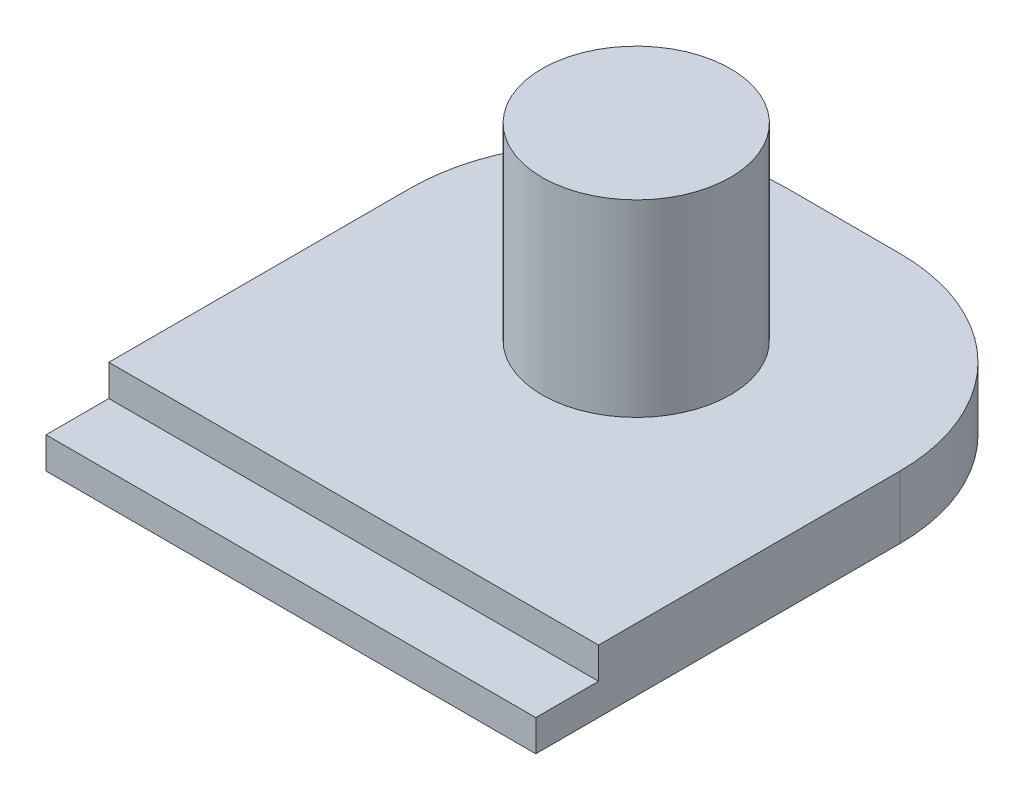
ISO-10303-21;
HEADER;
FILE_DESCRIPTION(('STEP AP214'),'2;1');
FILE_NAME('part.step','',(''),(''),'','','');
FILE_SCHEMA(('AUTOMOTIVE_DESIGN { 1 0 10303 214 1 1 1 1 }'));
ENDSEC;
DATA;
#1=APPLICATION_CONTEXT('core data for automotive mechanical design processes');
#2=APPLICATION_PROTOCOL_DEFINITION('international standard','automotive_design',2000,#1);
#3=PRODUCT_CONTEXT('',#1,'mechanical');
#4=PRODUCT('Part','Part','',(#3));
#5=PRODUCT_RELATED_PRODUCT_CATEGORY('part','',(#4));
#6=PRODUCT_DEFINITION_FORMATION('','',#4);
#7=PRODUCT_DEFINITION_CONTEXT('part definition',#1,'design');
#8=PRODUCT_DEFINITION('design','',#6,#7);
#9=PRODUCT_DEFINITION_SHAPE('','',#8);
#10=(LENGTH_UNIT() NAMED_UNIT(*) SI_UNIT(.MILLI.,.METRE.));
#11=(NAMED_UNIT(*) PLANE_ANGLE_UNIT() SI_UNIT($,.RADIAN.));
#12=(NAMED_UNIT(*) SI_UNIT($,.STERADIAN.) SOLID_ANGLE_UNIT());
#13=UNCERTAINTY_MEASURE_WITH_UNIT(LENGTH_MEASURE(1.E-05),#10,'distance_accuracy_value','');
#14=(GEOMETRIC_REPRESENTATION_CONTEXT(3) GLOBAL_UNCERTAINTY_ASSIGNED_CONTEXT((#13)) GLOBAL_UNIT_ASSIGNED_CONTEXT((#10,
#11,#12)) REPRESENTATION_CONTEXT('',''));
#15=CARTESIAN_POINT('',(0.,0.,0.));
#16=DIRECTION('',(0.,0.,1.));
#17=DIRECTION('',(1.,0.,0.));
#18=AXIS2_PLACEMENT_3D('',#15,#16,#17);
#19=CARTESIAN_POINT('',(0.,1.,0.));
#20=DIRECTION('',(1.,0.,0.));
#21=DIRECTION('',(0.,0.,-1.));
#22=AXIS2_PLACEMENT_3D('',#19,#20,#21);
#23=PLANE('',#22);
#24=DIRECTION('',(0.,0.,1.));
#25=VECTOR('',#24,1.);
#26=CARTESIAN_POINT('',(0.,0.5,0.));
#27=LINE('',#26,#25);
#28=CARTESIAN_POINT('',(0.,0.5,-1.));
#29=VERTEX_POINT('',#28);
#30=CARTESIAN_POINT('',(0.,0.5,0.));
#31=VERTEX_POINT('',#30);
#32=EDGE_CURVE('E105',#29,#31,#27,.T.);
#33=ORIENTED_EDGE('',*,*,#32,.F.);
#34=DIRECTION('',(0.,1.,0.));
#35=VECTOR('',#34,1.);
#36=CARTESIAN_POINT('',(0.,0.5,-1.));
#37=LINE('',#36,#35);
#38=CARTESIAN_POINT('',(0.,1.,-1.));
#39=VERTEX_POINT('',#38);
#40=EDGE_CURVE('E176',#29,#39,#37,.T.);
#41=ORIENTED_EDGE('',*,*,#40,.T.);
#42=DIRECTION('',(0.,0.,1.));
#43=VECTOR('',#42,1.);
#44=CARTESIAN_POINT('',(0.,1.,0.));
#45=LINE('',#44,#43);
#46=CARTESIAN_POINT('',(0.,1.,-5.79999999999998));
#47=VERTEX_POINT('',#46);
#48=EDGE_CURVE('E146',#47,#39,#45,.T.);
#49=ORIENTED_EDGE('',*,*,#48,.F.);
#50=DIRECTION('',(0.,-1.,0.));
#51=VECTOR('',#50,1.);
#52=CARTESIAN_POINT('',(0.,1.,-5.79999999999998));
#53=LINE('',#52,#51);
#54=CARTESIAN_POINT('',(0.,0.,-5.79999999999998));
#55=VERTEX_POINT('',#54);
#56=EDGE_CURVE('E127',#47,#55,#53,.T.);
#57=ORIENTED_EDGE('',*,*,#56,.T.);
#58=DIRECTION('',(0.,0.,1.));
#59=VECTOR('',#58,1.);
#60=CARTESIAN_POINT('',(0.,0.,0.));
#61=LINE('',#60,#59);
#62=CARTESIAN_POINT('',(0.,0.,0.));
#63=VERTEX_POINT('',#62);
#64=EDGE_CURVE('E125',#55,#63,#61,.T.);
#65=ORIENTED_EDGE('',*,*,#64,.T.);
#66=DIRECTION('',(0.,-1.,0.));
#67=VECTOR('',#66,1.);
#68=CARTESIAN_POINT('',(0.,1.,0.));
#69=LINE('',#68,#67);
#70=EDGE_CURVE('E11',#31,#63,#69,.T.);
#71=ORIENTED_EDGE('',*,*,#70,.F.);
#72=EDGE_LOOP('',(#33,#41,#49,#57,#65,#71));
#73=FACE_BOUND('',#72,.T.);
#74=ADVANCED_FACE('F32',(#73),#23,.F.);
#75=CARTESIAN_POINT('',(0.,1.,0.));
#76=DIRECTION('',(0.,0.,-1.));
#77=DIRECTION('',(-1.,0.,0.));
#78=AXIS2_PLACEMENT_3D('',#75,#76,#77);
#79=PLANE('',#78);
#80=DIRECTION('',(0.,-1.,0.));
#81=VECTOR('',#80,1.);
#82=CARTESIAN_POINT('',(7.8,1.,0.));
#83=LINE('',#82,#81);
#84=CARTESIAN_POINT('',(7.8,0.5,0.));
#85=VERTEX_POINT('',#84);
#86=CARTESIAN_POINT('',(7.8,0.,0.));
#87=VERTEX_POINT('',#86);
#88=EDGE_CURVE('E39',#85,#87,#83,.T.);
#89=ORIENTED_EDGE('',*,*,#88,.F.);
#90=DIRECTION('',(1.,0.,0.));
#91=VECTOR('',#90,1.);
#92=CARTESIAN_POINT('',(0.,0.5,0.));
#93=LINE('',#92,#91);
#94=EDGE_CURVE('E108',#31,#85,#93,.T.);
#95=ORIENTED_EDGE('',*,*,#94,.F.);
#96=ORIENTED_EDGE('',*,*,#70,.T.);
#97=DIRECTION('',(1.,0.,0.));
#98=VECTOR('',#97,1.);
#99=CARTESIAN_POINT('',(0.,0.,0.));
#100=LINE('',#99,#98);
#101=EDGE_CURVE('E129',#63,#87,#100,.T.);
#102=ORIENTED_EDGE('',*,*,#101,.T.);
#103=EDGE_LOOP('',(#89,#95,#96,#102));
#104=FACE_BOUND('',#103,.T.);
#105=ADVANCED_FACE('F118',(#104),#79,.F.);
#106=CARTESIAN_POINT('',(7.8,1.,0.));
#107=DIRECTION('',(-1.,0.,0.));
#108=DIRECTION('',(0.,0.,1.));
#109=AXIS2_PLACEMENT_3D('',#106,#107,#108);
#110=PLANE('',#109);
#111=DIRECTION('',(0.,0.,-1.));
#112=VECTOR('',#111,1.);
#113=CARTESIAN_POINT('',(7.8,1.,0.));
#114=LINE('',#113,#112);
#115=CARTESIAN_POINT('',(7.8,1.,-1.));
#116=VERTEX_POINT('',#115);
#117=CARTESIAN_POINT('',(7.8,1.,-5.79999999999998));
#118=VERTEX_POINT('',#117);
#119=EDGE_CURVE('E87',#116,#118,#114,.T.);
#120=ORIENTED_EDGE('',*,*,#119,.F.);
#121=DIRECTION('',(0.,1.,0.));
#122=VECTOR('',#121,1.);
#123=CARTESIAN_POINT('',(7.8,0.5,-1.));
#124=LINE('',#123,#122);
#125=CARTESIAN_POINT('',(7.8,0.5,-1.));
#126=VERTEX_POINT('',#125);
#127=EDGE_CURVE('E46',#126,#116,#124,.T.);
#128=ORIENTED_EDGE('',*,*,#127,.F.);
#129=DIRECTION('',(0.,0.,-1.));
#130=VECTOR('',#129,1.);
#131=CARTESIAN_POINT('',(7.8,0.5,0.));
#132=LINE('',#131,#130);
#133=EDGE_CURVE('E121',#85,#126,#132,.T.);
#134=ORIENTED_EDGE('',*,*,#133,.F.);
#135=ORIENTED_EDGE('',*,*,#88,.T.);
#136=DIRECTION('',(0.,0.,-1.));
#137=VECTOR('',#136,1.);
#138=CARTESIAN_POINT('',(7.8,0.,0.));
#139=LINE('',#138,#137);
#140=CARTESIAN_POINT('',(7.8,0.,-5.79999999999998));
#141=VERTEX_POINT('',#140);
#142=EDGE_CURVE('E132',#87,#141,#139,.T.);
#143=ORIENTED_EDGE('',*,*,#142,.T.);
#144=DIRECTION('',(0.,-1.,0.));
#145=VECTOR('',#144,1.);
#146=CARTESIAN_POINT('',(7.8,1.,-5.79999999999998));
#147=LINE('',#146,#145);
#148=EDGE_CURVE('E153',#118,#141,#147,.T.);
#149=ORIENTED_EDGE('',*,*,#148,.F.);
#150=EDGE_LOOP('',(#120,#128,#134,#135,#143,#149));
#151=FACE_BOUND('',#150,.T.);
#152=ADVANCED_FACE('F156',(#151),#110,.F.);
#153=CARTESIAN_POINT('',(4.8,1.,-5.8));
#154=DIRECTION('',(0.,-1.,0.));
#155=DIRECTION('',(0.,0.,-1.));
#156=AXIS2_PLACEMENT_3D('',#153,#154,#155);
#157=CYLINDRICAL_SURFACE('',#156,3.);
#158=CARTESIAN_POINT('',(4.8,0.,-5.8));
#159=DIRECTION('',(0.,1.,0.));
#160=DIRECTION('',(0.,0.,1.));
#161=AXIS2_PLACEMENT_3D('',#158,#159,#160);
#162=CIRCLE('',#161,3.);
#163=CARTESIAN_POINT('',(4.79999999999998,0.,-8.8));
#164=VERTEX_POINT('',#163);
#165=EDGE_CURVE('E141',#141,#164,#162,.T.);
#166=ORIENTED_EDGE('',*,*,#165,.T.);
#167=DIRECTION('',(0.,-1.,0.));
#168=VECTOR('',#167,1.);
#169=CARTESIAN_POINT('',(4.79999999999998,1.,-8.8));
#170=LINE('',#169,#168);
#171=CARTESIAN_POINT('',(4.79999999999998,1.,-8.8));
#172=VERTEX_POINT('',#171);
#173=EDGE_CURVE('E150',#172,#164,#170,.T.);
#174=ORIENTED_EDGE('',*,*,#173,.F.);
#175=CARTESIAN_POINT('',(4.8,1.,-5.8));
#176=DIRECTION('',(0.,1.,0.));
#177=DIRECTION('',(0.,0.,1.));
#178=AXIS2_PLACEMENT_3D('',#175,#176,#177);
#179=CIRCLE('',#178,3.);
#180=EDGE_CURVE('E170',#118,#172,#179,.T.);
#181=ORIENTED_EDGE('',*,*,#180,.F.);
#182=ORIENTED_EDGE('',*,*,#148,.T.);
#183=EDGE_LOOP('',(#166,#174,#181,#182));
#184=FACE_BOUND('',#183,.T.);
#185=ADVANCED_FACE('F163',(#184),#157,.T.);
#186=CARTESIAN_POINT('',(3.00000000000002,1.,-8.8));
#187=DIRECTION('',(0.,0.,1.));
#188=DIRECTION('',(1.,0.,0.));
#189=AXIS2_PLACEMENT_3D('',#186,#187,#188);
#190=PLANE('',#189);
#191=DIRECTION('',(-1.,0.,0.));
#192=VECTOR('',#191,1.);
#193=CARTESIAN_POINT('',(3.00000000000002,0.,-8.8));
#194=LINE('',#193,#192);
#195=CARTESIAN_POINT('',(3.00000000000002,0.,-8.8));
#196=VERTEX_POINT('',#195);
#197=EDGE_CURVE('E143',#164,#196,#194,.T.);
#198=ORIENTED_EDGE('',*,*,#197,.T.);
#199=DIRECTION('',(0.,-1.,0.));
#200=VECTOR('',#199,1.);
#201=CARTESIAN_POINT('',(3.00000000000002,1.,-8.8));
#202=LINE('',#201,#200);
#203=CARTESIAN_POINT('',(3.00000000000002,1.,-8.8));
#204=VERTEX_POINT('',#203);
#205=EDGE_CURVE('E148',#204,#196,#202,.T.);
#206=ORIENTED_EDGE('',*,*,#205,.F.);
#207=DIRECTION('',(-1.,0.,0.));
#208=VECTOR('',#207,1.);
#209=CARTESIAN_POINT('',(3.00000000000002,1.,-8.8));
#210=LINE('',#209,#208);
#211=EDGE_CURVE('E169',#172,#204,#210,.T.);
#212=ORIENTED_EDGE('',*,*,#211,.F.);
#213=ORIENTED_EDGE('',*,*,#173,.T.);
#214=EDGE_LOOP('',(#198,#206,#212,#213));
#215=FACE_BOUND('',#214,.T.);
#216=ADVANCED_FACE('F167',(#215),#190,.F.);
#217=CARTESIAN_POINT('',(3.,1.,-5.8));
#218=DIRECTION('',(0.,-1.,0.));
#219=DIRECTION('',(0.,0.,-1.));
#220=AXIS2_PLACEMENT_3D('',#217,#218,#219);
#221=CYLINDRICAL_SURFACE('',#220,3.);
#222=CARTESIAN_POINT('',(3.,0.,-5.8));
#223=DIRECTION('',(0.,1.,0.));
#224=DIRECTION('',(0.,0.,1.));
#225=AXIS2_PLACEMENT_3D('',#222,#223,#224);
#226=CIRCLE('',#225,3.);
#227=EDGE_CURVE('E81',#196,#55,#226,.T.);
#228=ORIENTED_EDGE('',*,*,#227,.T.);
#229=ORIENTED_EDGE('',*,*,#56,.F.);
#230=CARTESIAN_POINT('',(3.,1.,-5.8));
#231=DIRECTION('',(0.,1.,0.));
#232=DIRECTION('',(0.,0.,1.));
#233=AXIS2_PLACEMENT_3D('',#230,#231,#232);
#234=CIRCLE('',#233,3.);
#235=EDGE_CURVE('E55',#204,#47,#234,.T.);
#236=ORIENTED_EDGE('',*,*,#235,.F.);
#237=ORIENTED_EDGE('',*,*,#205,.T.);
#238=EDGE_LOOP('',(#228,#229,#236,#237));
#239=FACE_BOUND('',#238,.T.);
#240=ADVANCED_FACE('F186',(#239),#221,.T.);
#241=CARTESIAN_POINT('',(3.,1.,-5.8));
#242=DIRECTION('',(0.,1.,0.));
#243=DIRECTION('',(0.,0.,1.));
#244=AXIS2_PLACEMENT_3D('',#241,#242,#243);
#245=PLANE('',#244);
#246=DIRECTION('',(-1.,0.,0.));
#247=VECTOR('',#246,1.);
#248=CARTESIAN_POINT('',(0.,1.,-1.));
#249=LINE('',#248,#247);
#250=EDGE_CURVE('E114',#116,#39,#249,.T.);
#251=ORIENTED_EDGE('',*,*,#250,.F.);
#252=ORIENTED_EDGE('',*,*,#119,.T.);
#253=ORIENTED_EDGE('',*,*,#180,.T.);
#254=ORIENTED_EDGE('',*,*,#211,.T.);
#255=ORIENTED_EDGE('',*,*,#235,.T.);
#256=ORIENTED_EDGE('',*,*,#48,.T.);
#257=EDGE_LOOP('',(#251,#252,#253,#254,#255,#256));
#258=FACE_BOUND('',#257,.T.);
#259=CARTESIAN_POINT('',(3.9,1.,-5.5));
#260=DIRECTION('',(0.,1.,0.));
#261=DIRECTION('',(0.,0.,1.));
#262=AXIS2_PLACEMENT_3D('',#259,#260,#261);
#263=CIRCLE('',#262,1.5);
#264=CARTESIAN_POINT('',(3.9,1.,-4.));
#265=VERTEX_POINT('',#264);
#266=EDGE_CURVE('E135',#265,#265,#263,.T.);
#267=ORIENTED_EDGE('',*,*,#266,.F.);
#268=EDGE_LOOP('',(#267));
#269=FACE_BOUND('',#268,.T.);
#270=ADVANCED_FACE('F183',(#258,#269),#245,.T.);
#271=CARTESIAN_POINT('',(3.,0.,-5.8));
#272=DIRECTION('',(0.,1.,0.));
#273=DIRECTION('',(0.,0.,1.));
#274=AXIS2_PLACEMENT_3D('',#271,#272,#273);
#275=PLANE('',#274);
#276=ORIENTED_EDGE('',*,*,#64,.F.);
#277=ORIENTED_EDGE('',*,*,#227,.F.);
#278=ORIENTED_EDGE('',*,*,#197,.F.);
#279=ORIENTED_EDGE('',*,*,#165,.F.);
#280=ORIENTED_EDGE('',*,*,#142,.F.);
#281=ORIENTED_EDGE('',*,*,#101,.F.);
#282=EDGE_LOOP('',(#276,#277,#278,#279,#280,#281));
#283=FACE_BOUND('',#282,.T.);
#284=ADVANCED_FACE('F159',(#283),#275,.F.);
#285=CARTESIAN_POINT('',(3.9,4.,-5.5));
#286=DIRECTION('',(0.,-1.,0.));
#287=DIRECTION('',(0.,0.,-1.));
#288=AXIS2_PLACEMENT_3D('',#285,#286,#287);
#289=CYLINDRICAL_SURFACE('',#288,1.5);
#290=CARTESIAN_POINT('',(3.9,4.,-5.5));
#291=DIRECTION('',(0.,1.,0.));
#292=DIRECTION('',(0.,0.,1.));
#293=AXIS2_PLACEMENT_3D('',#290,#291,#292);
#294=CIRCLE('',#293,1.5);
#295=CARTESIAN_POINT('',(3.9,4.,-4.));
#296=VERTEX_POINT('',#295);
#297=EDGE_CURVE('E130',#296,#296,#294,.T.);
#298=ORIENTED_EDGE('',*,*,#297,.F.);
#299=EDGE_LOOP('',(#298));
#300=FACE_BOUND('',#299,.T.);
#301=ORIENTED_EDGE('',*,*,#266,.T.);
#302=EDGE_LOOP('',(#301));
#303=FACE_BOUND('',#302,.T.);
#304=ADVANCED_FACE('F190',(#300,#303),#289,.T.);
#305=CARTESIAN_POINT('',(3.9,4.,-5.5));
#306=DIRECTION('',(0.,1.,0.));
#307=DIRECTION('',(0.,0.,1.));
#308=AXIS2_PLACEMENT_3D('',#305,#306,#307);
#309=PLANE('',#308);
#310=ORIENTED_EDGE('',*,*,#297,.T.);
#311=EDGE_LOOP('',(#310));
#312=FACE_BOUND('',#311,.T.);
#313=ADVANCED_FACE('F192',(#312),#309,.T.);
#314=CARTESIAN_POINT('',(0.,0.5,-1.));
#315=DIRECTION('',(0.,0.,-1.));
#316=DIRECTION('',(-1.,0.,0.));
#317=AXIS2_PLACEMENT_3D('',#314,#315,#316);
#318=PLANE('',#317);
#319=ORIENTED_EDGE('',*,*,#250,.T.);
#320=ORIENTED_EDGE('',*,*,#40,.F.);
#321=DIRECTION('',(-1.,0.,0.));
#322=VECTOR('',#321,1.);
#323=CARTESIAN_POINT('',(0.,0.5,-1.));
#324=LINE('',#323,#322);
#325=EDGE_CURVE('E110',#126,#29,#324,.T.);
#326=ORIENTED_EDGE('',*,*,#325,.F.);
#327=ORIENTED_EDGE('',*,*,#127,.T.);
#328=EDGE_LOOP('',(#319,#320,#326,#327));
#329=FACE_BOUND('',#328,.T.);
#330=ADVANCED_FACE('F182',(#329),#318,.F.);
#331=CARTESIAN_POINT('',(0.,0.5,0.));
#332=DIRECTION('',(0.,-1.,0.));
#333=DIRECTION('',(0.,0.,-1.));
#334=AXIS2_PLACEMENT_3D('',#331,#332,#333);
#335=PLANE('',#334);
#336=ORIENTED_EDGE('',*,*,#32,.T.);
#337=ORIENTED_EDGE('',*,*,#94,.T.);
#338=ORIENTED_EDGE('',*,*,#133,.T.);
#339=ORIENTED_EDGE('',*,*,#325,.T.);
#340=EDGE_LOOP('',(#336,#337,#338,#339));
#341=FACE_BOUND('',#340,.T.);
#342=ADVANCED_FACE('F107',(#341),#335,.F.);
#343=CLOSED_SHELL('',(#74,#105,#152,#185,#216,#240,#270,#284,#304,#313,#330,#342));
#344=MANIFOLD_SOLID_BREP('B2',#343);
#345=ADVANCED_BREP_SHAPE_REPRESENTATION('',(#18,#344),#14);
#346=SHAPE_DEFINITION_REPRESENTATION(#9,#345);
ENDSEC;
END-ISO-10303-21;
